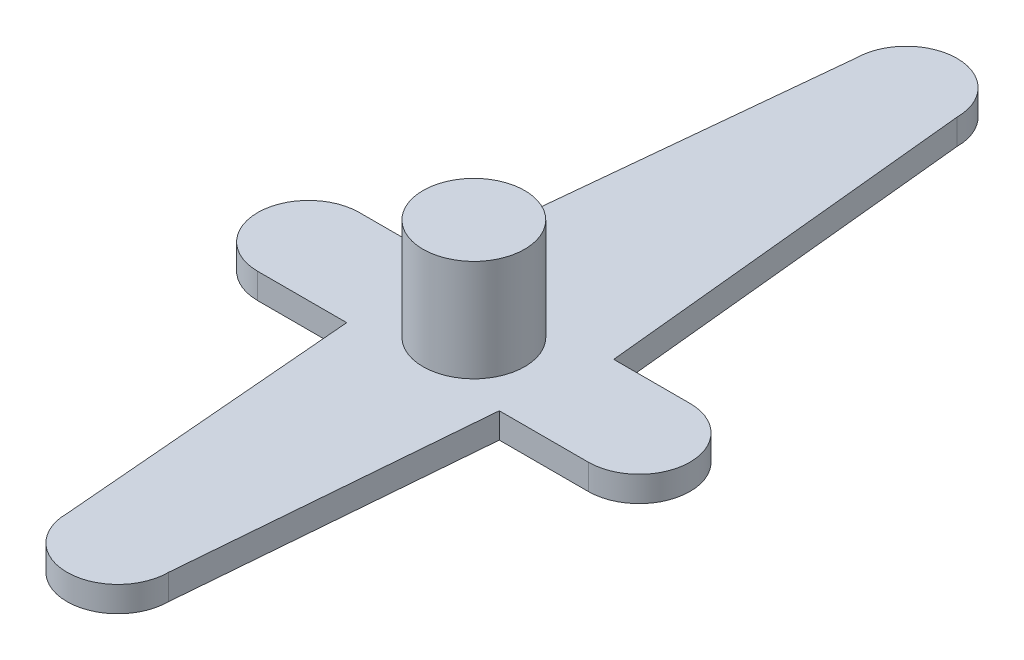
ISO-10303-21;
HEADER;
FILE_DESCRIPTION(('STEP AP214'),'2;1');
FILE_NAME('part.step','',(''),(''),'','','');
FILE_SCHEMA(('AUTOMOTIVE_DESIGN { 1 0 10303 214 1 1 1 1 }'));
ENDSEC;
DATA;
#1=APPLICATION_CONTEXT('core data for automotive mechanical design processes');
#2=APPLICATION_PROTOCOL_DEFINITION('international standard','automotive_design',2000,#1);
#3=PRODUCT_CONTEXT('',#1,'mechanical');
#4=PRODUCT('Part','Part','',(#3));
#5=PRODUCT_RELATED_PRODUCT_CATEGORY('part','',(#4));
#6=PRODUCT_DEFINITION_FORMATION('','',#4);
#7=PRODUCT_DEFINITION_CONTEXT('part definition',#1,'design');
#8=PRODUCT_DEFINITION('design','',#6,#7);
#9=PRODUCT_DEFINITION_SHAPE('','',#8);
#10=(LENGTH_UNIT() NAMED_UNIT(*) SI_UNIT(.MILLI.,.METRE.));
#11=(NAMED_UNIT(*) PLANE_ANGLE_UNIT() SI_UNIT($,.RADIAN.));
#12=(NAMED_UNIT(*) SI_UNIT($,.STERADIAN.) SOLID_ANGLE_UNIT());
#13=UNCERTAINTY_MEASURE_WITH_UNIT(LENGTH_MEASURE(1.E-05),#10,'distance_accuracy_value','');
#14=(GEOMETRIC_REPRESENTATION_CONTEXT(3) GLOBAL_UNCERTAINTY_ASSIGNED_CONTEXT((#13)) GLOBAL_UNIT_ASSIGNED_CONTEXT((#10,
#11,#12)) REPRESENTATION_CONTEXT('',''));
#15=CARTESIAN_POINT('',(0.,0.,0.));
#16=DIRECTION('',(0.,0.,1.));
#17=DIRECTION('',(1.,0.,0.));
#18=AXIS2_PLACEMENT_3D('',#15,#16,#17);
#19=CARTESIAN_POINT('',(0.,1.,-17.));
#20=DIRECTION('',(0.,-1.,0.));
#21=DIRECTION('',(0.,0.,-1.));
#22=AXIS2_PLACEMENT_3D('',#19,#20,#21);
#23=CYLINDRICAL_SURFACE('',#22,2.);
#24=CARTESIAN_POINT('',(0.,0.,-17.));
#25=DIRECTION('',(0.,1.,0.));
#26=DIRECTION('',(0.,0.,1.));
#27=AXIS2_PLACEMENT_3D('',#24,#25,#26);
#28=CIRCLE('',#27,2.);
#29=CARTESIAN_POINT('',(-2.,0.,-17.));
#30=VERTEX_POINT('',#29);
#31=CARTESIAN_POINT('',(2.,0.,-17.));
#32=VERTEX_POINT('',#31);
#33=EDGE_CURVE('E170',#30,#32,#28,.F.);
#34=ORIENTED_EDGE('',*,*,#33,.F.);
#35=DIRECTION('',(0.,-1.,0.));
#36=VECTOR('',#35,1.);
#37=CARTESIAN_POINT('',(-2.,1.,-17.));
#38=LINE('',#37,#36);
#39=CARTESIAN_POINT('',(-2.,1.,-17.));
#40=VERTEX_POINT('',#39);
#41=EDGE_CURVE('E11',#40,#30,#38,.T.);
#42=ORIENTED_EDGE('',*,*,#41,.F.);
#43=CARTESIAN_POINT('',(0.,1.,-17.));
#44=DIRECTION('',(0.,1.,0.));
#45=DIRECTION('',(0.,0.,1.));
#46=AXIS2_PLACEMENT_3D('',#43,#44,#45);
#47=CIRCLE('',#46,2.);
#48=CARTESIAN_POINT('',(2.,1.,-17.));
#49=VERTEX_POINT('',#48);
#50=EDGE_CURVE('E159',#40,#49,#47,.F.);
#51=ORIENTED_EDGE('',*,*,#50,.T.);
#52=DIRECTION('',(0.,-1.,0.));
#53=VECTOR('',#52,1.);
#54=CARTESIAN_POINT('',(2.,1.,-17.));
#55=LINE('',#54,#53);
#56=EDGE_CURVE('E95',#49,#32,#55,.T.);
#57=ORIENTED_EDGE('',*,*,#56,.T.);
#58=EDGE_LOOP('',(#34,#42,#51,#57));
#59=FACE_BOUND('',#58,.T.);
#60=ADVANCED_FACE('F33',(#59),#23,.T.);
#61=CARTESIAN_POINT('',(-3.66336633663366,1.,-0.366336633663366));
#62=DIRECTION('',(-0.995037190209989,0.,-0.0995037190209989));
#63=DIRECTION('',(-0.0995037190209989,0.,0.995037190209989));
#64=AXIS2_PLACEMENT_3D('',#61,#62,#63);
#65=PLANE('',#64);
#66=DIRECTION('',(0.0995037190209989,0.,-0.995037190209989));
#67=VECTOR('',#66,1.);
#68=CARTESIAN_POINT('',(-3.66336633663366,0.,-0.366336633663366));
#69=LINE('',#68,#67);
#70=CARTESIAN_POINT('',(-3.5,0.,-2.));
#71=VERTEX_POINT('',#70);
#72=EDGE_CURVE('E174',#71,#30,#69,.T.);
#73=ORIENTED_EDGE('',*,*,#72,.F.);
#74=DIRECTION('',(0.,-1.,0.));
#75=VECTOR('',#74,1.);
#76=CARTESIAN_POINT('',(-3.5,1.,-2.));
#77=LINE('',#76,#75);
#78=CARTESIAN_POINT('',(-3.5,1.,-2.));
#79=VERTEX_POINT('',#78);
#80=EDGE_CURVE('E41',#79,#71,#77,.T.);
#81=ORIENTED_EDGE('',*,*,#80,.F.);
#82=DIRECTION('',(0.0995037190209989,0.,-0.995037190209989));
#83=VECTOR('',#82,1.);
#84=CARTESIAN_POINT('',(-3.66336633663366,1.,-0.366336633663366));
#85=LINE('',#84,#83);
#86=EDGE_CURVE('E154',#79,#40,#85,.T.);
#87=ORIENTED_EDGE('',*,*,#86,.T.);
#88=ORIENTED_EDGE('',*,*,#41,.T.);
#89=EDGE_LOOP('',(#73,#81,#87,#88));
#90=FACE_BOUND('',#89,.T.);
#91=ADVANCED_FACE('F219',(#90),#65,.T.);
#92=CARTESIAN_POINT('',(0.,1.,-2.));
#93=DIRECTION('',(0.,0.,-1.));
#94=DIRECTION('',(-1.,0.,0.));
#95=AXIS2_PLACEMENT_3D('',#92,#93,#94);
#96=PLANE('',#95);
#97=DIRECTION('',(1.,0.,0.));
#98=VECTOR('',#97,1.);
#99=CARTESIAN_POINT('',(0.,0.,-2.));
#100=LINE('',#99,#98);
#101=CARTESIAN_POINT('',(-6.5,0.,-2.));
#102=VERTEX_POINT('',#101);
#103=EDGE_CURVE('E178',#102,#71,#100,.T.);
#104=ORIENTED_EDGE('',*,*,#103,.F.);
#105=DIRECTION('',(0.,-1.,0.));
#106=VECTOR('',#105,1.);
#107=CARTESIAN_POINT('',(-6.5,1.,-2.));
#108=LINE('',#107,#106);
#109=CARTESIAN_POINT('',(-6.5,1.,-2.));
#110=VERTEX_POINT('',#109);
#111=EDGE_CURVE('E215',#110,#102,#108,.T.);
#112=ORIENTED_EDGE('',*,*,#111,.F.);
#113=DIRECTION('',(1.,0.,0.));
#114=VECTOR('',#113,1.);
#115=CARTESIAN_POINT('',(0.,1.,-2.));
#116=LINE('',#115,#114);
#117=EDGE_CURVE('E148',#110,#79,#116,.T.);
#118=ORIENTED_EDGE('',*,*,#117,.T.);
#119=ORIENTED_EDGE('',*,*,#80,.T.);
#120=EDGE_LOOP('',(#104,#112,#118,#119));
#121=FACE_BOUND('',#120,.T.);
#122=ADVANCED_FACE('F218',(#121),#96,.T.);
#123=CARTESIAN_POINT('',(-6.5,1.,0.));
#124=DIRECTION('',(0.,-1.,0.));
#125=DIRECTION('',(0.,0.,-1.));
#126=AXIS2_PLACEMENT_3D('',#123,#124,#125);
#127=CYLINDRICAL_SURFACE('',#126,2.);
#128=CARTESIAN_POINT('',(-6.5,0.,0.));
#129=DIRECTION('',(0.,1.,0.));
#130=DIRECTION('',(0.,0.,1.));
#131=AXIS2_PLACEMENT_3D('',#128,#129,#130);
#132=CIRCLE('',#131,2.);
#133=CARTESIAN_POINT('',(-6.5,0.,2.));
#134=VERTEX_POINT('',#133);
#135=EDGE_CURVE('E183',#102,#134,#132,.T.);
#136=ORIENTED_EDGE('',*,*,#135,.T.);
#137=DIRECTION('',(0.,-1.,0.));
#138=VECTOR('',#137,1.);
#139=CARTESIAN_POINT('',(-6.5,1.,2.));
#140=LINE('',#139,#138);
#141=CARTESIAN_POINT('',(-6.5,1.,2.));
#142=VERTEX_POINT('',#141);
#143=EDGE_CURVE('E212',#142,#134,#140,.T.);
#144=ORIENTED_EDGE('',*,*,#143,.F.);
#145=CARTESIAN_POINT('',(-6.5,1.,0.));
#146=DIRECTION('',(0.,1.,0.));
#147=DIRECTION('',(0.,0.,1.));
#148=AXIS2_PLACEMENT_3D('',#145,#146,#147);
#149=CIRCLE('',#148,2.);
#150=EDGE_CURVE('E153',#110,#142,#149,.T.);
#151=ORIENTED_EDGE('',*,*,#150,.F.);
#152=ORIENTED_EDGE('',*,*,#111,.T.);
#153=EDGE_LOOP('',(#136,#144,#151,#152));
#154=FACE_BOUND('',#153,.T.);
#155=ADVANCED_FACE('F226',(#154),#127,.T.);
#156=CARTESIAN_POINT('',(0.,1.,2.));
#157=DIRECTION('',(0.,0.,-1.));
#158=DIRECTION('',(-1.,0.,0.));
#159=AXIS2_PLACEMENT_3D('',#156,#157,#158);
#160=PLANE('',#159);
#161=DIRECTION('',(1.,0.,0.));
#162=VECTOR('',#161,1.);
#163=CARTESIAN_POINT('',(0.,0.,2.));
#164=LINE('',#163,#162);
#165=CARTESIAN_POINT('',(-3.,0.,2.));
#166=VERTEX_POINT('',#165);
#167=EDGE_CURVE('E186',#134,#166,#164,.T.);
#168=ORIENTED_EDGE('',*,*,#167,.T.);
#169=DIRECTION('',(0.,-1.,0.));
#170=VECTOR('',#169,1.);
#171=CARTESIAN_POINT('',(-3.,1.,2.));
#172=LINE('',#171,#170);
#173=CARTESIAN_POINT('',(-3.,1.,2.));
#174=VERTEX_POINT('',#173);
#175=EDGE_CURVE('E209',#174,#166,#172,.T.);
#176=ORIENTED_EDGE('',*,*,#175,.F.);
#177=DIRECTION('',(1.,0.,0.));
#178=VECTOR('',#177,1.);
#179=CARTESIAN_POINT('',(0.,1.,2.));
#180=LINE('',#179,#178);
#181=EDGE_CURVE('E157',#142,#174,#180,.T.);
#182=ORIENTED_EDGE('',*,*,#181,.F.);
#183=ORIENTED_EDGE('',*,*,#143,.T.);
#184=EDGE_LOOP('',(#168,#176,#182,#183));
#185=FACE_BOUND('',#184,.T.);
#186=ADVANCED_FACE('F230',(#185),#160,.F.);
#187=CARTESIAN_POINT('',(-3.1448275862069,1.,0.262068965517241));
#188=DIRECTION('',(0.99654575824488,0.,-0.0830454798537399));
#189=DIRECTION('',(-0.0830454798537399,0.,-0.99654575824488));
#190=AXIS2_PLACEMENT_3D('',#187,#188,#189);
#191=PLANE('',#190);
#192=DIRECTION('',(0.0830454798537399,0.,0.99654575824488));
#193=VECTOR('',#192,1.);
#194=CARTESIAN_POINT('',(-3.1448275862069,0.,0.262068965517241));
#195=LINE('',#194,#193);
#196=CARTESIAN_POINT('',(-2.,0.,14.));
#197=VERTEX_POINT('',#196);
#198=EDGE_CURVE('E188',#166,#197,#195,.T.);
#199=ORIENTED_EDGE('',*,*,#198,.T.);
#200=DIRECTION('',(0.,-1.,0.));
#201=VECTOR('',#200,1.);
#202=CARTESIAN_POINT('',(-2.,1.,14.));
#203=LINE('',#202,#201);
#204=CARTESIAN_POINT('',(-2.,1.,14.));
#205=VERTEX_POINT('',#204);
#206=EDGE_CURVE('E206',#205,#197,#203,.T.);
#207=ORIENTED_EDGE('',*,*,#206,.F.);
#208=DIRECTION('',(0.0830454798537399,0.,0.99654575824488));
#209=VECTOR('',#208,1.);
#210=CARTESIAN_POINT('',(-3.1448275862069,1.,0.262068965517241));
#211=LINE('',#210,#209);
#212=EDGE_CURVE('E233',#174,#205,#211,.T.);
#213=ORIENTED_EDGE('',*,*,#212,.F.);
#214=ORIENTED_EDGE('',*,*,#175,.T.);
#215=EDGE_LOOP('',(#199,#207,#213,#214));
#216=FACE_BOUND('',#215,.T.);
#217=ADVANCED_FACE('F262',(#216),#191,.F.);
#218=CARTESIAN_POINT('',(0.,1.,14.));
#219=DIRECTION('',(0.,-1.,0.));
#220=DIRECTION('',(0.,0.,-1.));
#221=AXIS2_PLACEMENT_3D('',#218,#219,#220);
#222=CYLINDRICAL_SURFACE('',#221,2.);
#223=CARTESIAN_POINT('',(0.,0.,14.));
#224=DIRECTION('',(0.,1.,0.));
#225=DIRECTION('',(0.,0.,1.));
#226=AXIS2_PLACEMENT_3D('',#223,#224,#225);
#227=CIRCLE('',#226,2.);
#228=CARTESIAN_POINT('',(2.,0.,14.));
#229=VERTEX_POINT('',#228);
#230=EDGE_CURVE('E191',#197,#229,#227,.T.);
#231=ORIENTED_EDGE('',*,*,#230,.T.);
#232=DIRECTION('',(0.,-1.,0.));
#233=VECTOR('',#232,1.);
#234=CARTESIAN_POINT('',(2.,1.,14.));
#235=LINE('',#234,#233);
#236=CARTESIAN_POINT('',(2.,1.,14.));
#237=VERTEX_POINT('',#236);
#238=EDGE_CURVE('E204',#237,#229,#235,.T.);
#239=ORIENTED_EDGE('',*,*,#238,.F.);
#240=CARTESIAN_POINT('',(0.,1.,14.));
#241=DIRECTION('',(0.,1.,0.));
#242=DIRECTION('',(0.,0.,1.));
#243=AXIS2_PLACEMENT_3D('',#240,#241,#242);
#244=CIRCLE('',#243,2.);
#245=EDGE_CURVE('E235',#205,#237,#244,.T.);
#246=ORIENTED_EDGE('',*,*,#245,.F.);
#247=ORIENTED_EDGE('',*,*,#206,.T.);
#248=EDGE_LOOP('',(#231,#239,#246,#247));
#249=FACE_BOUND('',#248,.T.);
#250=ADVANCED_FACE('F246',(#249),#222,.T.);
#251=CARTESIAN_POINT('',(3.1448275862069,1.,0.262068965517242));
#252=DIRECTION('',(0.99654575824488,0.,0.0830454798537401));
#253=DIRECTION('',(0.0830454798537401,0.,-0.99654575824488));
#254=AXIS2_PLACEMENT_3D('',#251,#252,#253);
#255=PLANE('',#254);
#256=DIRECTION('',(-0.0830454798537401,0.,0.99654575824488));
#257=VECTOR('',#256,1.);
#258=CARTESIAN_POINT('',(3.1448275862069,0.,0.262068965517242));
#259=LINE('',#258,#257);
#260=CARTESIAN_POINT('',(3.,0.,2.));
#261=VERTEX_POINT('',#260);
#262=EDGE_CURVE('E194',#261,#229,#259,.T.);
#263=ORIENTED_EDGE('',*,*,#262,.F.);
#264=DIRECTION('',(0.,-1.,0.));
#265=VECTOR('',#264,1.);
#266=CARTESIAN_POINT('',(3.,1.,2.));
#267=LINE('',#266,#265);
#268=CARTESIAN_POINT('',(3.,1.,2.));
#269=VERTEX_POINT('',#268);
#270=EDGE_CURVE('E202',#269,#261,#267,.T.);
#271=ORIENTED_EDGE('',*,*,#270,.F.);
#272=DIRECTION('',(-0.0830454798537401,0.,0.99654575824488));
#273=VECTOR('',#272,1.);
#274=CARTESIAN_POINT('',(3.1448275862069,1.,0.262068965517242));
#275=LINE('',#274,#273);
#276=EDGE_CURVE('E237',#269,#237,#275,.T.);
#277=ORIENTED_EDGE('',*,*,#276,.T.);
#278=ORIENTED_EDGE('',*,*,#238,.T.);
#279=EDGE_LOOP('',(#263,#271,#277,#278));
#280=FACE_BOUND('',#279,.T.);
#281=ADVANCED_FACE('F249',(#280),#255,.T.);
#282=CARTESIAN_POINT('',(6.5,0.,2.));
#283=VERTEX_POINT('',#282);
#284=EDGE_CURVE('E189',#261,#283,#164,.T.);
#285=ORIENTED_EDGE('',*,*,#284,.T.);
#286=DIRECTION('',(0.,-1.,0.));
#287=VECTOR('',#286,1.);
#288=CARTESIAN_POINT('',(6.5,1.,2.));
#289=LINE('',#288,#287);
#290=CARTESIAN_POINT('',(6.5,1.,2.));
#291=VERTEX_POINT('',#290);
#292=EDGE_CURVE('E144',#291,#283,#289,.T.);
#293=ORIENTED_EDGE('',*,*,#292,.F.);
#294=EDGE_CURVE('E131',#269,#291,#180,.T.);
#295=ORIENTED_EDGE('',*,*,#294,.F.);
#296=ORIENTED_EDGE('',*,*,#270,.T.);
#297=EDGE_LOOP('',(#285,#293,#295,#296));
#298=FACE_BOUND('',#297,.T.);
#299=ADVANCED_FACE('F252',(#298),#160,.F.);
#300=CARTESIAN_POINT('',(6.5,1.,0.));
#301=DIRECTION('',(0.,-1.,0.));
#302=DIRECTION('',(0.,0.,-1.));
#303=AXIS2_PLACEMENT_3D('',#300,#301,#302);
#304=CYLINDRICAL_SURFACE('',#303,2.);
#305=CARTESIAN_POINT('',(6.5,0.,0.));
#306=DIRECTION('',(0.,1.,0.));
#307=DIRECTION('',(0.,0.,1.));
#308=AXIS2_PLACEMENT_3D('',#305,#306,#307);
#309=CIRCLE('',#308,2.);
#310=CARTESIAN_POINT('',(6.5,0.,-2.));
#311=VERTEX_POINT('',#310);
#312=EDGE_CURVE('E140',#283,#311,#309,.T.);
#313=ORIENTED_EDGE('',*,*,#312,.T.);
#314=DIRECTION('',(0.,-1.,0.));
#315=VECTOR('',#314,1.);
#316=CARTESIAN_POINT('',(6.5,1.,-2.));
#317=LINE('',#316,#315);
#318=CARTESIAN_POINT('',(6.5,1.,-2.));
#319=VERTEX_POINT('',#318);
#320=EDGE_CURVE('E137',#319,#311,#317,.T.);
#321=ORIENTED_EDGE('',*,*,#320,.F.);
#322=CARTESIAN_POINT('',(6.5,1.,0.));
#323=DIRECTION('',(0.,1.,0.));
#324=DIRECTION('',(0.,0.,1.));
#325=AXIS2_PLACEMENT_3D('',#322,#323,#324);
#326=CIRCLE('',#325,2.);
#327=EDGE_CURVE('E124',#291,#319,#326,.T.);
#328=ORIENTED_EDGE('',*,*,#327,.F.);
#329=ORIENTED_EDGE('',*,*,#292,.T.);
#330=EDGE_LOOP('',(#313,#321,#328,#329));
#331=FACE_BOUND('',#330,.T.);
#332=ADVANCED_FACE('F138',(#331),#304,.T.);
#333=CARTESIAN_POINT('',(3.5,0.,-2.));
#334=VERTEX_POINT('',#333);
#335=EDGE_CURVE('E184',#334,#311,#100,.T.);
#336=ORIENTED_EDGE('',*,*,#335,.F.);
#337=DIRECTION('',(0.,-1.,0.));
#338=VECTOR('',#337,1.);
#339=CARTESIAN_POINT('',(3.5,1.,-2.));
#340=LINE('',#339,#338);
#341=CARTESIAN_POINT('',(3.5,1.,-2.));
#342=VERTEX_POINT('',#341);
#343=EDGE_CURVE('E88',#342,#334,#340,.T.);
#344=ORIENTED_EDGE('',*,*,#343,.F.);
#345=EDGE_CURVE('E128',#342,#319,#116,.T.);
#346=ORIENTED_EDGE('',*,*,#345,.T.);
#347=ORIENTED_EDGE('',*,*,#320,.T.);
#348=EDGE_LOOP('',(#336,#344,#346,#347));
#349=FACE_BOUND('',#348,.T.);
#350=ADVANCED_FACE('F146',(#349),#96,.T.);
#351=CARTESIAN_POINT('',(3.66336633663366,1.,-0.366336633663367));
#352=DIRECTION('',(-0.995037190209989,0.,0.099503719020999));
#353=DIRECTION('',(0.099503719020999,0.,0.995037190209989));
#354=AXIS2_PLACEMENT_3D('',#351,#352,#353);
#355=PLANE('',#354);
#356=DIRECTION('',(-0.099503719020999,0.,-0.995037190209989));
#357=VECTOR('',#356,1.);
#358=CARTESIAN_POINT('',(3.66336633663366,0.,-0.366336633663367));
#359=LINE('',#358,#357);
#360=EDGE_CURVE('E162',#334,#32,#359,.T.);
#361=ORIENTED_EDGE('',*,*,#360,.T.);
#362=ORIENTED_EDGE('',*,*,#56,.F.);
#363=DIRECTION('',(-0.099503719020999,0.,-0.995037190209989));
#364=VECTOR('',#363,1.);
#365=CARTESIAN_POINT('',(3.66336633663366,1.,-0.366336633663367));
#366=LINE('',#365,#364);
#367=EDGE_CURVE('E49',#342,#49,#366,.T.);
#368=ORIENTED_EDGE('',*,*,#367,.F.);
#369=ORIENTED_EDGE('',*,*,#343,.T.);
#370=EDGE_LOOP('',(#361,#362,#368,#369));
#371=FACE_BOUND('',#370,.T.);
#372=ADVANCED_FACE('F305',(#371),#355,.F.);
#373=CARTESIAN_POINT('',(0.,1.,0.));
#374=DIRECTION('',(0.,1.,0.));
#375=DIRECTION('',(0.,0.,1.));
#376=AXIS2_PLACEMENT_3D('',#373,#374,#375);
#377=PLANE('',#376);
#378=CARTESIAN_POINT('',(0.,1.,0.));
#379=DIRECTION('',(0.,1.,0.));
#380=DIRECTION('',(0.,0.,1.));
#381=AXIS2_PLACEMENT_3D('',#378,#379,#380);
#382=CIRCLE('',#381,2.);
#383=CARTESIAN_POINT('',(0.,1.,2.));
#384=VERTEX_POINT('',#383);
#385=EDGE_CURVE('E165',#384,#384,#382,.T.);
#386=ORIENTED_EDGE('',*,*,#385,.F.);
#387=EDGE_LOOP('',(#386));
#388=FACE_BOUND('',#387,.T.);
#389=ORIENTED_EDGE('',*,*,#50,.F.);
#390=ORIENTED_EDGE('',*,*,#86,.F.);
#391=ORIENTED_EDGE('',*,*,#117,.F.);
#392=ORIENTED_EDGE('',*,*,#150,.T.);
#393=ORIENTED_EDGE('',*,*,#181,.T.);
#394=ORIENTED_EDGE('',*,*,#212,.T.);
#395=ORIENTED_EDGE('',*,*,#245,.T.);
#396=ORIENTED_EDGE('',*,*,#276,.F.);
#397=ORIENTED_EDGE('',*,*,#294,.T.);
#398=ORIENTED_EDGE('',*,*,#327,.T.);
#399=ORIENTED_EDGE('',*,*,#345,.F.);
#400=ORIENTED_EDGE('',*,*,#367,.T.);
#401=EDGE_LOOP('',(#389,#390,#391,#392,#393,#394,#395,#396,#397,#398,#399,#400));
#402=FACE_BOUND('',#401,.T.);
#403=ADVANCED_FACE('F126',(#388,#402),#377,.T.);
#404=CARTESIAN_POINT('',(0.,0.,0.));
#405=DIRECTION('',(0.,1.,0.));
#406=DIRECTION('',(0.,0.,1.));
#407=AXIS2_PLACEMENT_3D('',#404,#405,#406);
#408=PLANE('',#407);
#409=ORIENTED_EDGE('',*,*,#33,.T.);
#410=ORIENTED_EDGE('',*,*,#360,.F.);
#411=ORIENTED_EDGE('',*,*,#335,.T.);
#412=ORIENTED_EDGE('',*,*,#312,.F.);
#413=ORIENTED_EDGE('',*,*,#284,.F.);
#414=ORIENTED_EDGE('',*,*,#262,.T.);
#415=ORIENTED_EDGE('',*,*,#230,.F.);
#416=ORIENTED_EDGE('',*,*,#198,.F.);
#417=ORIENTED_EDGE('',*,*,#167,.F.);
#418=ORIENTED_EDGE('',*,*,#135,.F.);
#419=ORIENTED_EDGE('',*,*,#103,.T.);
#420=ORIENTED_EDGE('',*,*,#72,.T.);
#421=EDGE_LOOP('',(#409,#410,#411,#412,#413,#414,#415,#416,#417,#418,#419,#420));
#422=FACE_BOUND('',#421,.T.);
#423=ADVANCED_FACE('F221',(#422),#408,.F.);
#424=CARTESIAN_POINT('',(0.,5.,0.));
#425=DIRECTION('',(0.,-1.,0.));
#426=DIRECTION('',(0.,0.,-1.));
#427=AXIS2_PLACEMENT_3D('',#424,#425,#426);
#428=CYLINDRICAL_SURFACE('',#427,2.);
#429=CARTESIAN_POINT('',(0.,5.,0.));
#430=DIRECTION('',(0.,1.,0.));
#431=DIRECTION('',(0.,0.,1.));
#432=AXIS2_PLACEMENT_3D('',#429,#430,#431);
#433=CIRCLE('',#432,2.);
#434=CARTESIAN_POINT('',(0.,5.,2.));
#435=VERTEX_POINT('',#434);
#436=EDGE_CURVE('E168',#435,#435,#433,.T.);
#437=ORIENTED_EDGE('',*,*,#436,.F.);
#438=EDGE_LOOP('',(#437));
#439=FACE_BOUND('',#438,.T.);
#440=ORIENTED_EDGE('',*,*,#385,.T.);
#441=EDGE_LOOP('',(#440));
#442=FACE_BOUND('',#441,.T.);
#443=ADVANCED_FACE('F323',(#439,#442),#428,.T.);
#444=CARTESIAN_POINT('',(0.,5.,0.));
#445=DIRECTION('',(0.,1.,0.));
#446=DIRECTION('',(0.,0.,1.));
#447=AXIS2_PLACEMENT_3D('',#444,#445,#446);
#448=PLANE('',#447);
#449=ORIENTED_EDGE('',*,*,#436,.T.);
#450=EDGE_LOOP('',(#449));
#451=FACE_BOUND('',#450,.T.);
#452=ADVANCED_FACE('F343',(#451),#448,.T.);
#453=CLOSED_SHELL('',(#60,#91,#122,#155,#186,#217,#250,#281,#299,#332,#350,#372,#403,#423,#443,#452));
#454=MANIFOLD_SOLID_BREP('B2',#453);
#455=ADVANCED_BREP_SHAPE_REPRESENTATION('',(#18,#454),#14);
#456=SHAPE_DEFINITION_REPRESENTATION(#9,#455);
ENDSEC;
END-ISO-10303-21;
